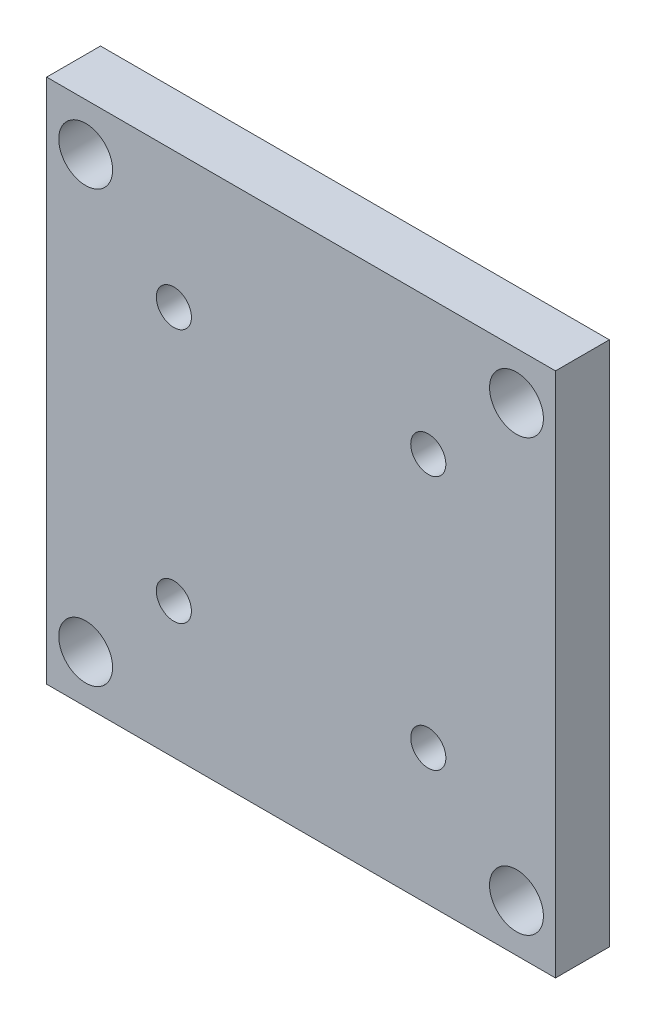
ISO-10303-21;
HEADER;
FILE_DESCRIPTION(('STEP AP214'),'2;1');
FILE_NAME('part.step','',(''),(''),'','','');
FILE_SCHEMA(('AUTOMOTIVE_DESIGN { 1 0 10303 214 1 1 1 1 }'));
ENDSEC;
DATA;
#1=APPLICATION_CONTEXT('core data for automotive mechanical design processes');
#2=APPLICATION_PROTOCOL_DEFINITION('international standard','automotive_design',2000,#1);
#3=PRODUCT_CONTEXT('',#1,'mechanical');
#4=PRODUCT('Part','Part','',(#3));
#5=PRODUCT_RELATED_PRODUCT_CATEGORY('part','',(#4));
#6=PRODUCT_DEFINITION_FORMATION('','',#4);
#7=PRODUCT_DEFINITION_CONTEXT('part definition',#1,'design');
#8=PRODUCT_DEFINITION('design','',#6,#7);
#9=PRODUCT_DEFINITION_SHAPE('','',#8);
#10=(LENGTH_UNIT() NAMED_UNIT(*) SI_UNIT(.MILLI.,.METRE.));
#11=(NAMED_UNIT(*) PLANE_ANGLE_UNIT() SI_UNIT($,.RADIAN.));
#12=(NAMED_UNIT(*) SI_UNIT($,.STERADIAN.) SOLID_ANGLE_UNIT());
#13=UNCERTAINTY_MEASURE_WITH_UNIT(LENGTH_MEASURE(1.E-05),#10,'distance_accuracy_value','');
#14=(GEOMETRIC_REPRESENTATION_CONTEXT(3) GLOBAL_UNCERTAINTY_ASSIGNED_CONTEXT((#13)) GLOBAL_UNIT_ASSIGNED_CONTEXT((#10,
#11,#12)) REPRESENTATION_CONTEXT('',''));
#15=CARTESIAN_POINT('',(0.,0.,0.));
#16=DIRECTION('',(0.,0.,1.));
#17=DIRECTION('',(1.,0.,0.));
#18=AXIS2_PLACEMENT_3D('',#15,#16,#17);
#19=CARTESIAN_POINT('',(0.,0.,6.35));
#20=DIRECTION('',(0.,0.,-1.));
#21=DIRECTION('',(-1.,0.,0.));
#22=AXIS2_PLACEMENT_3D('',#19,#20,#21);
#23=PLANE('',#22);
#24=DIRECTION('',(0.,1.,0.));
#25=VECTOR('',#24,1.);
#26=CARTESIAN_POINT('',(30.,-31.,6.35));
#27=LINE('',#26,#25);
#28=CARTESIAN_POINT('',(30.,-31.,6.35));
#29=VERTEX_POINT('',#28);
#30=CARTESIAN_POINT('',(30.,31.,6.35));
#31=VERTEX_POINT('',#30);
#32=EDGE_CURVE('E85',#29,#31,#27,.T.);
#33=ORIENTED_EDGE('',*,*,#32,.T.);
#34=DIRECTION('',(-1.,0.,0.));
#35=VECTOR('',#34,1.);
#36=CARTESIAN_POINT('',(-30.,31.,6.35));
#37=LINE('',#36,#35);
#38=CARTESIAN_POINT('',(-30.,31.,6.35));
#39=VERTEX_POINT('',#38);
#40=EDGE_CURVE('E80',#31,#39,#37,.T.);
#41=ORIENTED_EDGE('',*,*,#40,.T.);
#42=DIRECTION('',(0.,-1.,0.));
#43=VECTOR('',#42,1.);
#44=CARTESIAN_POINT('',(-30.,-31.,6.35));
#45=LINE('',#44,#43);
#46=CARTESIAN_POINT('',(-30.,-31.,6.35));
#47=VERTEX_POINT('',#46);
#48=EDGE_CURVE('E83',#39,#47,#45,.T.);
#49=ORIENTED_EDGE('',*,*,#48,.T.);
#50=DIRECTION('',(1.,0.,0.));
#51=VECTOR('',#50,1.);
#52=CARTESIAN_POINT('',(-30.,-31.,6.35));
#53=LINE('',#52,#51);
#54=EDGE_CURVE('E50',#47,#29,#53,.T.);
#55=ORIENTED_EDGE('',*,*,#54,.T.);
#56=EDGE_LOOP('',(#33,#41,#49,#55));
#57=FACE_BOUND('',#56,.T.);
#58=CARTESIAN_POINT('',(25.4,25.4,6.35));
#59=DIRECTION('',(0.,0.,1.));
#60=DIRECTION('',(1.,0.,0.));
#61=AXIS2_PLACEMENT_3D('',#58,#59,#60);
#62=CIRCLE('',#61,3.175);
#63=CARTESIAN_POINT('',(28.575,25.4,6.35));
#64=VERTEX_POINT('',#63);
#65=EDGE_CURVE('E100',#64,#64,#62,.T.);
#66=ORIENTED_EDGE('',*,*,#65,.F.);
#67=EDGE_LOOP('',(#66));
#68=FACE_BOUND('',#67,.T.);
#69=CARTESIAN_POINT('',(-25.4,25.4,6.35));
#70=DIRECTION('',(0.,0.,1.));
#71=DIRECTION('',(-1.,0.,0.));
#72=AXIS2_PLACEMENT_3D('',#69,#70,#71);
#73=CIRCLE('',#72,3.175);
#74=CARTESIAN_POINT('',(-28.575,25.4,6.35));
#75=VERTEX_POINT('',#74);
#76=EDGE_CURVE('E115',#75,#75,#73,.T.);
#77=ORIENTED_EDGE('',*,*,#76,.F.);
#78=EDGE_LOOP('',(#77));
#79=FACE_BOUND('',#78,.T.);
#80=CARTESIAN_POINT('',(25.4,-25.4,6.35));
#81=DIRECTION('',(0.,0.,1.));
#82=DIRECTION('',(-1.,0.,0.));
#83=AXIS2_PLACEMENT_3D('',#80,#81,#82);
#84=CIRCLE('',#83,3.175);
#85=CARTESIAN_POINT('',(22.225,-25.4,6.35));
#86=VERTEX_POINT('',#85);
#87=EDGE_CURVE('E121',#86,#86,#84,.T.);
#88=ORIENTED_EDGE('',*,*,#87,.F.);
#89=EDGE_LOOP('',(#88));
#90=FACE_BOUND('',#89,.T.);
#91=CARTESIAN_POINT('',(-25.4,-25.4,6.35));
#92=DIRECTION('',(0.,0.,1.));
#93=DIRECTION('',(1.,0.,0.));
#94=AXIS2_PLACEMENT_3D('',#91,#92,#93);
#95=CIRCLE('',#94,3.175);
#96=CARTESIAN_POINT('',(-22.225,-25.4,6.35));
#97=VERTEX_POINT('',#96);
#98=EDGE_CURVE('E127',#97,#97,#95,.T.);
#99=ORIENTED_EDGE('',*,*,#98,.F.);
#100=EDGE_LOOP('',(#99));
#101=FACE_BOUND('',#100,.T.);
#102=CARTESIAN_POINT('',(-15.,15.,6.35));
#103=DIRECTION('',(0.,0.,1.));
#104=DIRECTION('',(1.,0.,0.));
#105=AXIS2_PLACEMENT_3D('',#102,#103,#104);
#106=CIRCLE('',#105,2.071);
#107=CARTESIAN_POINT('',(-12.929,15.,6.35));
#108=VERTEX_POINT('',#107);
#109=EDGE_CURVE('E133',#108,#108,#106,.T.);
#110=ORIENTED_EDGE('',*,*,#109,.F.);
#111=EDGE_LOOP('',(#110));
#112=FACE_BOUND('',#111,.T.);
#113=CARTESIAN_POINT('',(-15.,-15.,6.35));
#114=DIRECTION('',(0.,0.,1.));
#115=DIRECTION('',(-1.,0.,0.));
#116=AXIS2_PLACEMENT_3D('',#113,#114,#115);
#117=CIRCLE('',#116,2.071);
#118=CARTESIAN_POINT('',(-17.071,-15.,6.35));
#119=VERTEX_POINT('',#118);
#120=EDGE_CURVE('E139',#119,#119,#117,.T.);
#121=ORIENTED_EDGE('',*,*,#120,.F.);
#122=EDGE_LOOP('',(#121));
#123=FACE_BOUND('',#122,.T.);
#124=CARTESIAN_POINT('',(15.,-15.,6.35));
#125=DIRECTION('',(0.,0.,1.));
#126=DIRECTION('',(1.,0.,0.));
#127=AXIS2_PLACEMENT_3D('',#124,#125,#126);
#128=CIRCLE('',#127,2.071);
#129=CARTESIAN_POINT('',(17.071,-15.,6.35));
#130=VERTEX_POINT('',#129);
#131=EDGE_CURVE('E145',#130,#130,#128,.T.);
#132=ORIENTED_EDGE('',*,*,#131,.F.);
#133=EDGE_LOOP('',(#132));
#134=FACE_BOUND('',#133,.T.);
#135=CARTESIAN_POINT('',(15.,15.,6.35));
#136=DIRECTION('',(0.,0.,1.));
#137=DIRECTION('',(-1.,0.,0.));
#138=AXIS2_PLACEMENT_3D('',#135,#136,#137);
#139=CIRCLE('',#138,2.071);
#140=CARTESIAN_POINT('',(12.929,15.,6.35));
#141=VERTEX_POINT('',#140);
#142=EDGE_CURVE('E151',#141,#141,#139,.T.);
#143=ORIENTED_EDGE('',*,*,#142,.F.);
#144=EDGE_LOOP('',(#143));
#145=FACE_BOUND('',#144,.T.);
#146=ADVANCED_FACE('F33',(#57,#68,#79,#90,#101,#112,#123,#134,#145),#23,.F.);
#147=CARTESIAN_POINT('',(0.,0.,0.));
#148=DIRECTION('',(0.,0.,-1.));
#149=DIRECTION('',(-1.,0.,0.));
#150=AXIS2_PLACEMENT_3D('',#147,#148,#149);
#151=PLANE('',#150);
#152=CARTESIAN_POINT('',(15.,-15.,0.));
#153=DIRECTION('',(0.,0.,1.));
#154=DIRECTION('',(1.,0.,0.));
#155=AXIS2_PLACEMENT_3D('',#152,#153,#154);
#156=CIRCLE('',#155,2.071);
#157=CARTESIAN_POINT('',(17.071,-15.,0.));
#158=VERTEX_POINT('',#157);
#159=EDGE_CURVE('E148',#158,#158,#156,.T.);
#160=ORIENTED_EDGE('',*,*,#159,.T.);
#161=EDGE_LOOP('',(#160));
#162=FACE_BOUND('',#161,.T.);
#163=CARTESIAN_POINT('',(-15.,15.,0.));
#164=DIRECTION('',(0.,0.,1.));
#165=DIRECTION('',(1.,0.,0.));
#166=AXIS2_PLACEMENT_3D('',#163,#164,#165);
#167=CIRCLE('',#166,2.071);
#168=CARTESIAN_POINT('',(-12.929,15.,0.));
#169=VERTEX_POINT('',#168);
#170=EDGE_CURVE('E136',#169,#169,#167,.T.);
#171=ORIENTED_EDGE('',*,*,#170,.T.);
#172=EDGE_LOOP('',(#171));
#173=FACE_BOUND('',#172,.T.);
#174=CARTESIAN_POINT('',(25.4,-25.4,0.));
#175=DIRECTION('',(0.,0.,1.));
#176=DIRECTION('',(-1.,0.,0.));
#177=AXIS2_PLACEMENT_3D('',#174,#175,#176);
#178=CIRCLE('',#177,3.175);
#179=CARTESIAN_POINT('',(22.225,-25.4,0.));
#180=VERTEX_POINT('',#179);
#181=EDGE_CURVE('E124',#180,#180,#178,.T.);
#182=ORIENTED_EDGE('',*,*,#181,.T.);
#183=EDGE_LOOP('',(#182));
#184=FACE_BOUND('',#183,.T.);
#185=CARTESIAN_POINT('',(25.4,25.4,0.));
#186=DIRECTION('',(0.,0.,1.));
#187=DIRECTION('',(1.,0.,0.));
#188=AXIS2_PLACEMENT_3D('',#185,#186,#187);
#189=CIRCLE('',#188,3.175);
#190=CARTESIAN_POINT('',(28.575,25.4,0.));
#191=VERTEX_POINT('',#190);
#192=EDGE_CURVE('E112',#191,#191,#189,.T.);
#193=ORIENTED_EDGE('',*,*,#192,.T.);
#194=EDGE_LOOP('',(#193));
#195=FACE_BOUND('',#194,.T.);
#196=DIRECTION('',(0.,1.,0.));
#197=VECTOR('',#196,1.);
#198=CARTESIAN_POINT('',(30.,-31.,0.));
#199=LINE('',#198,#197);
#200=CARTESIAN_POINT('',(30.,-31.,0.));
#201=VERTEX_POINT('',#200);
#202=CARTESIAN_POINT('',(30.,31.,0.));
#203=VERTEX_POINT('',#202);
#204=EDGE_CURVE('E97',#201,#203,#199,.T.);
#205=ORIENTED_EDGE('',*,*,#204,.F.);
#206=DIRECTION('',(1.,0.,0.));
#207=VECTOR('',#206,1.);
#208=CARTESIAN_POINT('',(-30.,-31.,0.));
#209=LINE('',#208,#207);
#210=CARTESIAN_POINT('',(-30.,-31.,0.));
#211=VERTEX_POINT('',#210);
#212=EDGE_CURVE('E73',#211,#201,#209,.T.);
#213=ORIENTED_EDGE('',*,*,#212,.F.);
#214=DIRECTION('',(0.,-1.,0.));
#215=VECTOR('',#214,1.);
#216=CARTESIAN_POINT('',(-30.,-31.,0.));
#217=LINE('',#216,#215);
#218=CARTESIAN_POINT('',(-30.,31.,0.));
#219=VERTEX_POINT('',#218);
#220=EDGE_CURVE('E67',#219,#211,#217,.T.);
#221=ORIENTED_EDGE('',*,*,#220,.F.);
#222=DIRECTION('',(-1.,0.,0.));
#223=VECTOR('',#222,1.);
#224=CARTESIAN_POINT('',(-30.,31.,0.));
#225=LINE('',#224,#223);
#226=EDGE_CURVE('E89',#203,#219,#225,.T.);
#227=ORIENTED_EDGE('',*,*,#226,.F.);
#228=EDGE_LOOP('',(#205,#213,#221,#227));
#229=FACE_BOUND('',#228,.T.);
#230=CARTESIAN_POINT('',(-25.4,25.4,0.));
#231=DIRECTION('',(0.,0.,1.));
#232=DIRECTION('',(-1.,0.,0.));
#233=AXIS2_PLACEMENT_3D('',#230,#231,#232);
#234=CIRCLE('',#233,3.175);
#235=CARTESIAN_POINT('',(-28.575,25.4,0.));
#236=VERTEX_POINT('',#235);
#237=EDGE_CURVE('E118',#236,#236,#234,.T.);
#238=ORIENTED_EDGE('',*,*,#237,.T.);
#239=EDGE_LOOP('',(#238));
#240=FACE_BOUND('',#239,.T.);
#241=CARTESIAN_POINT('',(-25.4,-25.4,0.));
#242=DIRECTION('',(0.,0.,1.));
#243=DIRECTION('',(1.,0.,0.));
#244=AXIS2_PLACEMENT_3D('',#241,#242,#243);
#245=CIRCLE('',#244,3.175);
#246=CARTESIAN_POINT('',(-22.225,-25.4,0.));
#247=VERTEX_POINT('',#246);
#248=EDGE_CURVE('E130',#247,#247,#245,.T.);
#249=ORIENTED_EDGE('',*,*,#248,.T.);
#250=EDGE_LOOP('',(#249));
#251=FACE_BOUND('',#250,.T.);
#252=CARTESIAN_POINT('',(-15.,-15.,0.));
#253=DIRECTION('',(0.,0.,1.));
#254=DIRECTION('',(-1.,0.,0.));
#255=AXIS2_PLACEMENT_3D('',#252,#253,#254);
#256=CIRCLE('',#255,2.071);
#257=CARTESIAN_POINT('',(-17.071,-15.,0.));
#258=VERTEX_POINT('',#257);
#259=EDGE_CURVE('E142',#258,#258,#256,.T.);
#260=ORIENTED_EDGE('',*,*,#259,.T.);
#261=EDGE_LOOP('',(#260));
#262=FACE_BOUND('',#261,.T.);
#263=CARTESIAN_POINT('',(15.,15.,0.));
#264=DIRECTION('',(0.,0.,1.));
#265=DIRECTION('',(-1.,0.,0.));
#266=AXIS2_PLACEMENT_3D('',#263,#264,#265);
#267=CIRCLE('',#266,2.071);
#268=CARTESIAN_POINT('',(12.929,15.,0.));
#269=VERTEX_POINT('',#268);
#270=EDGE_CURVE('E154',#269,#269,#267,.T.);
#271=ORIENTED_EDGE('',*,*,#270,.T.);
#272=EDGE_LOOP('',(#271));
#273=FACE_BOUND('',#272,.T.);
#274=ADVANCED_FACE('F108',(#162,#173,#184,#195,#229,#240,#251,#262,#273),#151,.T.);
#275=CARTESIAN_POINT('',(30.,-31.,6.35));
#276=DIRECTION('',(-1.,0.,0.));
#277=DIRECTION('',(0.,0.,1.));
#278=AXIS2_PLACEMENT_3D('',#275,#276,#277);
#279=PLANE('',#278);
#280=ORIENTED_EDGE('',*,*,#204,.T.);
#281=DIRECTION('',(0.,0.,-1.));
#282=VECTOR('',#281,1.);
#283=CARTESIAN_POINT('',(30.,31.,6.35));
#284=LINE('',#283,#282);
#285=EDGE_CURVE('E11',#31,#203,#284,.T.);
#286=ORIENTED_EDGE('',*,*,#285,.F.);
#287=ORIENTED_EDGE('',*,*,#32,.F.);
#288=DIRECTION('',(0.,0.,-1.));
#289=VECTOR('',#288,1.);
#290=CARTESIAN_POINT('',(30.,-31.,6.35));
#291=LINE('',#290,#289);
#292=EDGE_CURVE('E93',#29,#201,#291,.T.);
#293=ORIENTED_EDGE('',*,*,#292,.T.);
#294=EDGE_LOOP('',(#280,#286,#287,#293));
#295=FACE_BOUND('',#294,.T.);
#296=ADVANCED_FACE('F35',(#295),#279,.F.);
#297=CARTESIAN_POINT('',(-30.,31.,6.35));
#298=DIRECTION('',(0.,-1.,0.));
#299=DIRECTION('',(0.,0.,-1.));
#300=AXIS2_PLACEMENT_3D('',#297,#298,#299);
#301=PLANE('',#300);
#302=ORIENTED_EDGE('',*,*,#226,.T.);
#303=DIRECTION('',(0.,0.,-1.));
#304=VECTOR('',#303,1.);
#305=CARTESIAN_POINT('',(-30.,31.,6.35));
#306=LINE('',#305,#304);
#307=EDGE_CURVE('E42',#39,#219,#306,.T.);
#308=ORIENTED_EDGE('',*,*,#307,.F.);
#309=ORIENTED_EDGE('',*,*,#40,.F.);
#310=ORIENTED_EDGE('',*,*,#285,.T.);
#311=EDGE_LOOP('',(#302,#308,#309,#310));
#312=FACE_BOUND('',#311,.T.);
#313=ADVANCED_FACE('F88',(#312),#301,.F.);
#314=CARTESIAN_POINT('',(-30.,-31.,6.35));
#315=DIRECTION('',(1.,0.,0.));
#316=DIRECTION('',(0.,0.,-1.));
#317=AXIS2_PLACEMENT_3D('',#314,#315,#316);
#318=PLANE('',#317);
#319=ORIENTED_EDGE('',*,*,#220,.T.);
#320=DIRECTION('',(0.,0.,-1.));
#321=VECTOR('',#320,1.);
#322=CARTESIAN_POINT('',(-30.,-31.,6.35));
#323=LINE('',#322,#321);
#324=EDGE_CURVE('E90',#47,#211,#323,.T.);
#325=ORIENTED_EDGE('',*,*,#324,.F.);
#326=ORIENTED_EDGE('',*,*,#48,.F.);
#327=ORIENTED_EDGE('',*,*,#307,.T.);
#328=EDGE_LOOP('',(#319,#325,#326,#327));
#329=FACE_BOUND('',#328,.T.);
#330=ADVANCED_FACE('F91',(#329),#318,.F.);
#331=CARTESIAN_POINT('',(-30.,-31.,6.35));
#332=DIRECTION('',(0.,1.,0.));
#333=DIRECTION('',(0.,0.,1.));
#334=AXIS2_PLACEMENT_3D('',#331,#332,#333);
#335=PLANE('',#334);
#336=ORIENTED_EDGE('',*,*,#212,.T.);
#337=ORIENTED_EDGE('',*,*,#292,.F.);
#338=ORIENTED_EDGE('',*,*,#54,.F.);
#339=ORIENTED_EDGE('',*,*,#324,.T.);
#340=EDGE_LOOP('',(#336,#337,#338,#339));
#341=FACE_BOUND('',#340,.T.);
#342=ADVANCED_FACE('F105',(#341),#335,.F.);
#343=CARTESIAN_POINT('',(25.4,25.4,6.35));
#344=DIRECTION('',(0.,0.,-1.));
#345=DIRECTION('',(-1.,0.,0.));
#346=AXIS2_PLACEMENT_3D('',#343,#344,#345);
#347=CYLINDRICAL_SURFACE('',#346,3.175);
#348=ORIENTED_EDGE('',*,*,#65,.T.);
#349=EDGE_LOOP('',(#348));
#350=FACE_BOUND('',#349,.T.);
#351=ORIENTED_EDGE('',*,*,#192,.F.);
#352=EDGE_LOOP('',(#351));
#353=FACE_BOUND('',#352,.T.);
#354=ADVANCED_FACE('F171',(#350,#353),#347,.F.);
#355=CARTESIAN_POINT('',(-25.4,25.4,6.35));
#356=DIRECTION('',(0.,0.,-1.));
#357=DIRECTION('',(-1.,0.,0.));
#358=AXIS2_PLACEMENT_3D('',#355,#356,#357);
#359=CYLINDRICAL_SURFACE('',#358,3.175);
#360=ORIENTED_EDGE('',*,*,#76,.T.);
#361=EDGE_LOOP('',(#360));
#362=FACE_BOUND('',#361,.T.);
#363=ORIENTED_EDGE('',*,*,#237,.F.);
#364=EDGE_LOOP('',(#363));
#365=FACE_BOUND('',#364,.T.);
#366=ADVANCED_FACE('F217',(#362,#365),#359,.F.);
#367=CARTESIAN_POINT('',(25.4,-25.4,6.35));
#368=DIRECTION('',(0.,0.,-1.));
#369=DIRECTION('',(-1.,0.,0.));
#370=AXIS2_PLACEMENT_3D('',#367,#368,#369);
#371=CYLINDRICAL_SURFACE('',#370,3.175);
#372=ORIENTED_EDGE('',*,*,#87,.T.);
#373=EDGE_LOOP('',(#372));
#374=FACE_BOUND('',#373,.T.);
#375=ORIENTED_EDGE('',*,*,#181,.F.);
#376=EDGE_LOOP('',(#375));
#377=FACE_BOUND('',#376,.T.);
#378=ADVANCED_FACE('F225',(#374,#377),#371,.F.);
#379=CARTESIAN_POINT('',(-25.4,-25.4,6.35));
#380=DIRECTION('',(0.,0.,-1.));
#381=DIRECTION('',(-1.,0.,0.));
#382=AXIS2_PLACEMENT_3D('',#379,#380,#381);
#383=CYLINDRICAL_SURFACE('',#382,3.175);
#384=ORIENTED_EDGE('',*,*,#98,.T.);
#385=EDGE_LOOP('',(#384));
#386=FACE_BOUND('',#385,.T.);
#387=ORIENTED_EDGE('',*,*,#248,.F.);
#388=EDGE_LOOP('',(#387));
#389=FACE_BOUND('',#388,.T.);
#390=ADVANCED_FACE('F233',(#386,#389),#383,.F.);
#391=CARTESIAN_POINT('',(-15.,15.,6.35));
#392=DIRECTION('',(0.,0.,-1.));
#393=DIRECTION('',(-1.,0.,0.));
#394=AXIS2_PLACEMENT_3D('',#391,#392,#393);
#395=CYLINDRICAL_SURFACE('',#394,2.071);
#396=ORIENTED_EDGE('',*,*,#109,.T.);
#397=EDGE_LOOP('',(#396));
#398=FACE_BOUND('',#397,.T.);
#399=ORIENTED_EDGE('',*,*,#170,.F.);
#400=EDGE_LOOP('',(#399));
#401=FACE_BOUND('',#400,.T.);
#402=ADVANCED_FACE('F242',(#398,#401),#395,.F.);
#403=CARTESIAN_POINT('',(-15.,-15.,6.35));
#404=DIRECTION('',(0.,0.,-1.));
#405=DIRECTION('',(-1.,0.,0.));
#406=AXIS2_PLACEMENT_3D('',#403,#404,#405);
#407=CYLINDRICAL_SURFACE('',#406,2.071);
#408=ORIENTED_EDGE('',*,*,#120,.T.);
#409=EDGE_LOOP('',(#408));
#410=FACE_BOUND('',#409,.T.);
#411=ORIENTED_EDGE('',*,*,#259,.F.);
#412=EDGE_LOOP('',(#411));
#413=FACE_BOUND('',#412,.T.);
#414=ADVANCED_FACE('F251',(#410,#413),#407,.F.);
#415=CARTESIAN_POINT('',(15.,-15.,6.35));
#416=DIRECTION('',(0.,0.,-1.));
#417=DIRECTION('',(-1.,0.,0.));
#418=AXIS2_PLACEMENT_3D('',#415,#416,#417);
#419=CYLINDRICAL_SURFACE('',#418,2.071);
#420=ORIENTED_EDGE('',*,*,#131,.T.);
#421=EDGE_LOOP('',(#420));
#422=FACE_BOUND('',#421,.T.);
#423=ORIENTED_EDGE('',*,*,#159,.F.);
#424=EDGE_LOOP('',(#423));
#425=FACE_BOUND('',#424,.T.);
#426=ADVANCED_FACE('F260',(#422,#425),#419,.F.);
#427=CARTESIAN_POINT('',(15.,15.,6.35));
#428=DIRECTION('',(0.,0.,-1.));
#429=DIRECTION('',(-1.,0.,0.));
#430=AXIS2_PLACEMENT_3D('',#427,#428,#429);
#431=CYLINDRICAL_SURFACE('',#430,2.071);
#432=ORIENTED_EDGE('',*,*,#142,.T.);
#433=EDGE_LOOP('',(#432));
#434=FACE_BOUND('',#433,.T.);
#435=ORIENTED_EDGE('',*,*,#270,.F.);
#436=EDGE_LOOP('',(#435));
#437=FACE_BOUND('',#436,.T.);
#438=ADVANCED_FACE('F160',(#434,#437),#431,.F.);
#439=CLOSED_SHELL('',(#146,#274,#296,#313,#330,#342,#354,#366,#378,#390,#402,#414,#426,#438));
#440=MANIFOLD_SOLID_BREP('B2',#439);
#441=ADVANCED_BREP_SHAPE_REPRESENTATION('',(#18,#440),#14);
#442=SHAPE_DEFINITION_REPRESENTATION(#9,#441);
ENDSEC;
END-ISO-10303-21;
